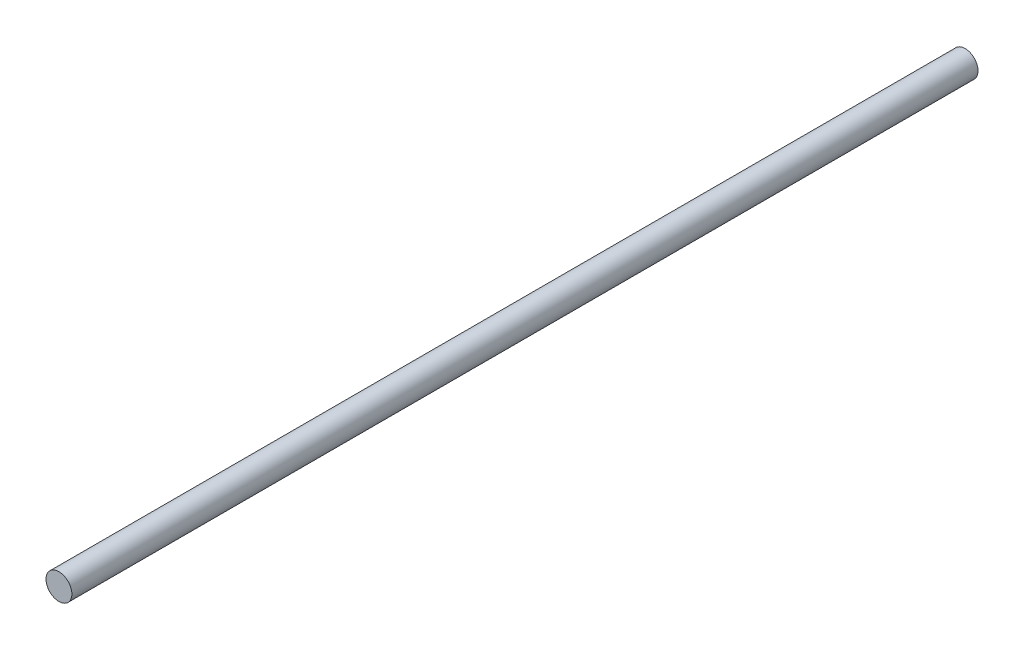
ISO-10303-21;
HEADER;
FILE_DESCRIPTION(('STEP AP214'),'2;1');
FILE_NAME('part.step','',(''),(''),'','','');
FILE_SCHEMA(('AUTOMOTIVE_DESIGN { 1 0 10303 214 1 1 1 1 }'));
ENDSEC;
DATA;
#1=APPLICATION_CONTEXT('core data for automotive mechanical design processes');
#2=APPLICATION_PROTOCOL_DEFINITION('international standard','automotive_design',2000,#1);
#3=PRODUCT_CONTEXT('',#1,'mechanical');
#4=PRODUCT('Part','Part','',(#3));
#5=PRODUCT_RELATED_PRODUCT_CATEGORY('part','',(#4));
#6=PRODUCT_DEFINITION_FORMATION('','',#4);
#7=PRODUCT_DEFINITION_CONTEXT('part definition',#1,'design');
#8=PRODUCT_DEFINITION('design','',#6,#7);
#9=PRODUCT_DEFINITION_SHAPE('','',#8);
#10=(LENGTH_UNIT() NAMED_UNIT(*) SI_UNIT(.MILLI.,.METRE.));
#11=(NAMED_UNIT(*) PLANE_ANGLE_UNIT() SI_UNIT($,.RADIAN.));
#12=(NAMED_UNIT(*) SI_UNIT($,.STERADIAN.) SOLID_ANGLE_UNIT());
#13=UNCERTAINTY_MEASURE_WITH_UNIT(LENGTH_MEASURE(1.E-05),#10,'distance_accuracy_value','');
#14=(GEOMETRIC_REPRESENTATION_CONTEXT(3) GLOBAL_UNCERTAINTY_ASSIGNED_CONTEXT((#13)) GLOBAL_UNIT_ASSIGNED_CONTEXT((#10,
#11,#12)) REPRESENTATION_CONTEXT('',''));
#15=CARTESIAN_POINT('',(0.,0.,0.));
#16=DIRECTION('',(0.,0.,1.));
#17=DIRECTION('',(1.,0.,0.));
#18=AXIS2_PLACEMENT_3D('',#15,#16,#17);
#19=CARTESIAN_POINT('',(0.,0.,287.5));
#20=DIRECTION('',(0.,0.,-1.));
#21=DIRECTION('',(-1.,0.,0.));
#22=AXIS2_PLACEMENT_3D('',#19,#20,#21);
#23=CYLINDRICAL_SURFACE('',#22,4.);
#24=CARTESIAN_POINT('',(0.,0.,332.5));
#25=DIRECTION('',(0.,0.,1.));
#26=DIRECTION('',(1.,0.,0.));
#27=AXIS2_PLACEMENT_3D('',#24,#25,#26);
#28=CIRCLE('',#27,4.);
#29=CARTESIAN_POINT('',(4.,0.,332.5));
#30=VERTEX_POINT('',#29);
#31=EDGE_CURVE('E10',#30,#30,#28,.T.);
#32=ORIENTED_EDGE('',*,*,#31,.F.);
#33=EDGE_LOOP('',(#32));
#34=FACE_BOUND('',#33,.T.);
#35=CARTESIAN_POINT('',(0.,0.,52.));
#36=DIRECTION('',(0.,0.,-1.));
#37=DIRECTION('',(-1.,0.,0.));
#38=AXIS2_PLACEMENT_3D('',#35,#36,#37);
#39=CIRCLE('',#38,4.);
#40=CARTESIAN_POINT('',(-4.,0.,52.));
#41=VERTEX_POINT('',#40);
#42=EDGE_CURVE('E40',#41,#41,#39,.T.);
#43=ORIENTED_EDGE('',*,*,#42,.F.);
#44=EDGE_LOOP('',(#43));
#45=FACE_BOUND('',#44,.T.);
#46=ADVANCED_FACE('F34',(#34,#45),#23,.T.);
#47=CARTESIAN_POINT('',(0.,0.,332.5));
#48=DIRECTION('',(0.,0.,1.));
#49=DIRECTION('',(1.,0.,0.));
#50=AXIS2_PLACEMENT_3D('',#47,#48,#49);
#51=PLANE('',#50);
#52=ORIENTED_EDGE('',*,*,#31,.T.);
#53=EDGE_LOOP('',(#52));
#54=FACE_BOUND('',#53,.T.);
#55=ADVANCED_FACE('F49',(#54),#51,.T.);
#56=CARTESIAN_POINT('',(0.,0.,52.));
#57=DIRECTION('',(0.,0.,-1.));
#58=DIRECTION('',(-1.,0.,0.));
#59=AXIS2_PLACEMENT_3D('',#56,#57,#58);
#60=PLANE('',#59);
#61=ORIENTED_EDGE('',*,*,#42,.T.);
#62=EDGE_LOOP('',(#61));
#63=FACE_BOUND('',#62,.T.);
#64=ADVANCED_FACE('F46',(#63),#60,.T.);
#65=CLOSED_SHELL('',(#46,#55,#64));
#66=MANIFOLD_SOLID_BREP('B2',#65);
#67=ADVANCED_BREP_SHAPE_REPRESENTATION('',(#18,#66),#14);
#68=SHAPE_DEFINITION_REPRESENTATION(#9,#67);
ENDSEC;
END-ISO-10303-21;
